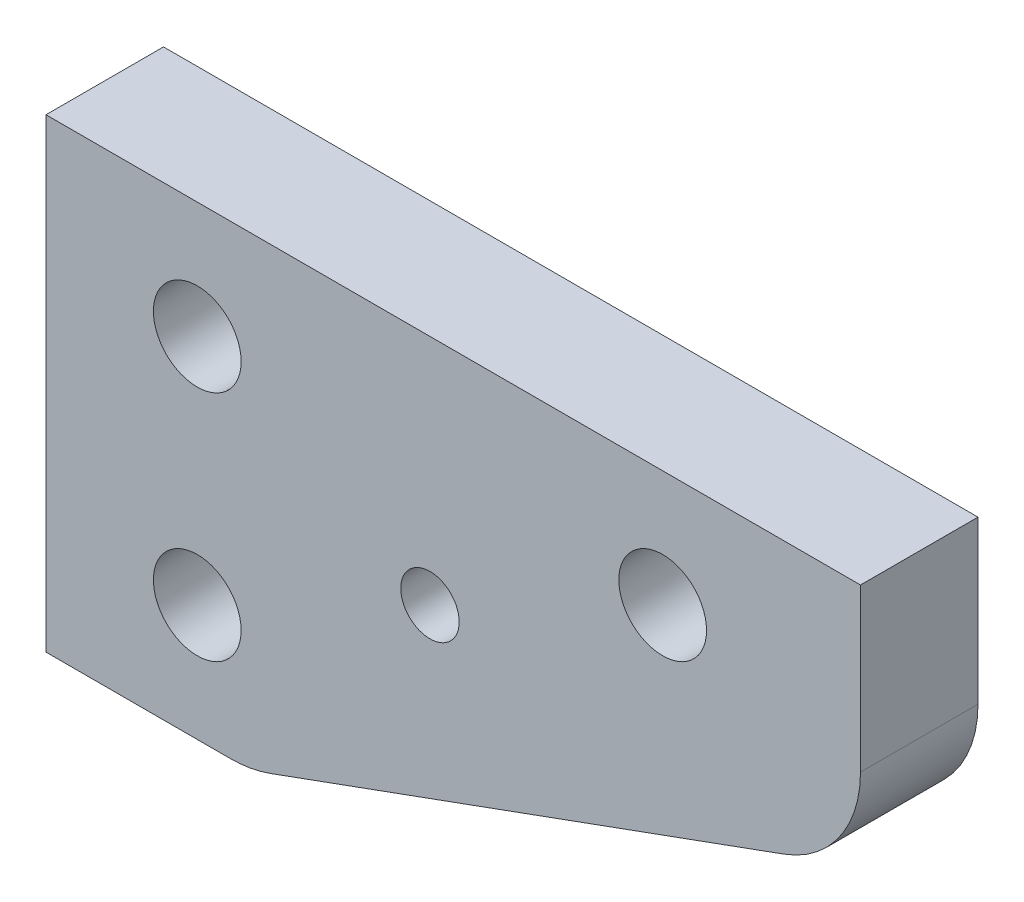
ISO-10303-21;
HEADER;
FILE_DESCRIPTION(('STEP AP214'),'2;1');
FILE_NAME('part.step','',(''),(''),'','','');
FILE_SCHEMA(('AUTOMOTIVE_DESIGN { 1 0 10303 214 1 1 1 1 }'));
ENDSEC;
DATA;
#1=APPLICATION_CONTEXT('core data for automotive mechanical design processes');
#2=APPLICATION_PROTOCOL_DEFINITION('international standard','automotive_design',2000,#1);
#3=PRODUCT_CONTEXT('',#1,'mechanical');
#4=PRODUCT('Part','Part','',(#3));
#5=PRODUCT_RELATED_PRODUCT_CATEGORY('part','',(#4));
#6=PRODUCT_DEFINITION_FORMATION('','',#4);
#7=PRODUCT_DEFINITION_CONTEXT('part definition',#1,'design');
#8=PRODUCT_DEFINITION('design','',#6,#7);
#9=PRODUCT_DEFINITION_SHAPE('','',#8);
#10=(LENGTH_UNIT() NAMED_UNIT(*) SI_UNIT(.MILLI.,.METRE.));
#11=(NAMED_UNIT(*) PLANE_ANGLE_UNIT() SI_UNIT($,.RADIAN.));
#12=(NAMED_UNIT(*) SI_UNIT($,.STERADIAN.) SOLID_ANGLE_UNIT());
#13=UNCERTAINTY_MEASURE_WITH_UNIT(LENGTH_MEASURE(1.E-05),#10,'distance_accuracy_value','');
#14=(GEOMETRIC_REPRESENTATION_CONTEXT(3) GLOBAL_UNCERTAINTY_ASSIGNED_CONTEXT((#13)) GLOBAL_UNIT_ASSIGNED_CONTEXT((#10,
#11,#12)) REPRESENTATION_CONTEXT('',''));
#15=CARTESIAN_POINT('',(0.,0.,0.));
#16=DIRECTION('',(0.,0.,1.));
#17=DIRECTION('',(1.,0.,0.));
#18=AXIS2_PLACEMENT_3D('',#15,#16,#17);
#19=CARTESIAN_POINT('',(0.,0.,6.4135));
#20=DIRECTION('',(0.,0.,1.));
#21=DIRECTION('',(1.,0.,0.));
#22=AXIS2_PLACEMENT_3D('',#19,#20,#21);
#23=PLANE('',#22);
#24=CARTESIAN_POINT('',(67.31,38.1,6.4135));
#25=DIRECTION('',(0.,0.,1.));
#26=DIRECTION('',(1.,0.,0.));
#27=AXIS2_PLACEMENT_3D('',#24,#25,#26);
#28=CIRCLE('',#27,4.7879);
#29=CARTESIAN_POINT('',(72.0979,38.1,6.4135));
#30=VERTEX_POINT('',#29);
#31=EDGE_CURVE('E210',#30,#30,#28,.T.);
#32=ORIENTED_EDGE('',*,*,#31,.F.);
#33=EDGE_LOOP('',(#32));
#34=FACE_BOUND('',#33,.T.);
#35=CARTESIAN_POINT('',(16.51,12.7,6.4135));
#36=DIRECTION('',(0.,0.,1.));
#37=DIRECTION('',(1.,0.,0.));
#38=AXIS2_PLACEMENT_3D('',#35,#36,#37);
#39=CIRCLE('',#38,4.7879);
#40=CARTESIAN_POINT('',(21.2979,12.7,6.4135));
#41=VERTEX_POINT('',#40);
#42=EDGE_CURVE('E193',#41,#41,#39,.T.);
#43=ORIENTED_EDGE('',*,*,#42,.F.);
#44=EDGE_LOOP('',(#43));
#45=FACE_BOUND('',#44,.T.);
#46=DIRECTION('',(0.939692620785908,0.342020143325669,0.));
#47=VECTOR('',#46,1.);
#48=CARTESIAN_POINT('',(22.352,0.,6.4135));
#49=LINE('',#48,#47);
#50=CARTESIAN_POINT('',(24.4563031652385,0.765903716018965,6.4135));
#51=VERTEX_POINT('',#50);
#52=CARTESIAN_POINT('',(80.543655820236,21.1800306012296,6.4135));
#53=VERTEX_POINT('',#52);
#54=EDGE_CURVE('E113',#51,#53,#49,.T.);
#55=ORIENTED_EDGE('',*,*,#54,.T.);
#56=CARTESIAN_POINT('',(76.2,33.1141268852106,6.4135));
#57=DIRECTION('',(0.,0.,1.));
#58=DIRECTION('',(1.,0.,0.));
#59=AXIS2_PLACEMENT_3D('',#56,#57,#58);
#60=CIRCLE('',#59,12.7);
#61=CARTESIAN_POINT('',(88.9,33.1141268852106,6.4135));
#62=VERTEX_POINT('',#61);
#63=EDGE_CURVE('E54',#53,#62,#60,.T.);
#64=ORIENTED_EDGE('',*,*,#63,.T.);
#65=DIRECTION('',(0.,1.,0.));
#66=VECTOR('',#65,1.);
#67=CARTESIAN_POINT('',(88.9,24.2214911499473,6.4135));
#68=LINE('',#67,#66);
#69=CARTESIAN_POINT('',(88.9,50.8,6.4135));
#70=VERTEX_POINT('',#69);
#71=EDGE_CURVE('E159',#62,#70,#68,.T.);
#72=ORIENTED_EDGE('',*,*,#71,.T.);
#73=DIRECTION('',(-1.,0.,0.));
#74=VECTOR('',#73,1.);
#75=CARTESIAN_POINT('',(88.9,50.8,6.4135));
#76=LINE('',#75,#74);
#77=CARTESIAN_POINT('',(0.,50.8,6.4135));
#78=VERTEX_POINT('',#77);
#79=EDGE_CURVE('E119',#70,#78,#76,.T.);
#80=ORIENTED_EDGE('',*,*,#79,.T.);
#81=DIRECTION('',(0.,-1.,0.));
#82=VECTOR('',#81,1.);
#83=CARTESIAN_POINT('',(0.,50.8,6.4135));
#84=LINE('',#83,#82);
#85=CARTESIAN_POINT('',(0.,0.,6.4135));
#86=VERTEX_POINT('',#85);
#87=EDGE_CURVE('E114',#78,#86,#84,.T.);
#88=ORIENTED_EDGE('',*,*,#87,.T.);
#89=DIRECTION('',(1.,0.,0.));
#90=VECTOR('',#89,1.);
#91=CARTESIAN_POINT('',(0.,0.,6.4135));
#92=LINE('',#91,#90);
#93=CARTESIAN_POINT('',(20.1126473450025,0.,6.4135));
#94=VERTEX_POINT('',#93);
#95=EDGE_CURVE('E104',#86,#94,#92,.T.);
#96=ORIENTED_EDGE('',*,*,#95,.T.);
#97=CARTESIAN_POINT('',(20.1126473450025,12.7,6.4135));
#98=DIRECTION('',(0.,0.,1.));
#99=DIRECTION('',(1.,0.,0.));
#100=AXIS2_PLACEMENT_3D('',#97,#98,#99);
#101=CIRCLE('',#100,12.7);
#102=EDGE_CURVE('E154',#94,#51,#101,.T.);
#103=ORIENTED_EDGE('',*,*,#102,.T.);
#104=EDGE_LOOP('',(#55,#64,#72,#80,#88,#96,#103));
#105=FACE_BOUND('',#104,.T.);
#106=CARTESIAN_POINT('',(16.51,38.1,6.4135));
#107=DIRECTION('',(0.,0.,1.));
#108=DIRECTION('',(1.,0.,0.));
#109=AXIS2_PLACEMENT_3D('',#106,#107,#108);
#110=CIRCLE('',#109,4.7879);
#111=CARTESIAN_POINT('',(21.2979,38.1,6.4135));
#112=VERTEX_POINT('',#111);
#113=EDGE_CURVE('E202',#112,#112,#110,.T.);
#114=ORIENTED_EDGE('',*,*,#113,.F.);
#115=EDGE_LOOP('',(#114));
#116=FACE_BOUND('',#115,.T.);
#117=CARTESIAN_POINT('',(41.91,25.4,6.4135));
#118=DIRECTION('',(0.,0.,1.));
#119=DIRECTION('',(1.,0.,0.));
#120=AXIS2_PLACEMENT_3D('',#117,#118,#119);
#121=CIRCLE('',#120,3.1877);
#122=CARTESIAN_POINT('',(45.0977,25.4,6.4135));
#123=VERTEX_POINT('',#122);
#124=EDGE_CURVE('E218',#123,#123,#121,.T.);
#125=ORIENTED_EDGE('',*,*,#124,.F.);
#126=EDGE_LOOP('',(#125));
#127=FACE_BOUND('',#126,.T.);
#128=ADVANCED_FACE('F45',(#34,#45,#105,#116,#127),#23,.T.);
#129=CARTESIAN_POINT('',(0.,0.,-6.4135));
#130=DIRECTION('',(0.,0.,1.));
#131=DIRECTION('',(1.,0.,0.));
#132=AXIS2_PLACEMENT_3D('',#129,#130,#131);
#133=PLANE('',#132);
#134=DIRECTION('',(0.,1.,0.));
#135=VECTOR('',#134,1.);
#136=CARTESIAN_POINT('',(88.9,24.2214911499473,-6.4135));
#137=LINE('',#136,#135);
#138=CARTESIAN_POINT('',(88.9,33.1141268852106,-6.4135));
#139=VERTEX_POINT('',#138);
#140=CARTESIAN_POINT('',(88.9,50.8,-6.4135));
#141=VERTEX_POINT('',#140);
#142=EDGE_CURVE('E175',#139,#141,#137,.T.);
#143=ORIENTED_EDGE('',*,*,#142,.F.);
#144=CARTESIAN_POINT('',(76.2,33.1141268852106,-6.4135));
#145=DIRECTION('',(0.,0.,1.));
#146=DIRECTION('',(1.,0.,0.));
#147=AXIS2_PLACEMENT_3D('',#144,#145,#146);
#148=CIRCLE('',#147,12.7);
#149=CARTESIAN_POINT('',(80.543655820236,21.1800306012296,-6.4135));
#150=VERTEX_POINT('',#149);
#151=EDGE_CURVE('E145',#139,#150,#148,.F.);
#152=ORIENTED_EDGE('',*,*,#151,.T.);
#153=DIRECTION('',(0.939692620785908,0.342020143325669,0.));
#154=VECTOR('',#153,1.);
#155=CARTESIAN_POINT('',(22.352,0.,-6.4135));
#156=LINE('',#155,#154);
#157=CARTESIAN_POINT('',(24.4563031652385,0.765903716018965,-6.4135));
#158=VERTEX_POINT('',#157);
#159=EDGE_CURVE('E173',#158,#150,#156,.T.);
#160=ORIENTED_EDGE('',*,*,#159,.F.);
#161=CARTESIAN_POINT('',(20.1126473450025,12.7,-6.4135));
#162=DIRECTION('',(0.,0.,1.));
#163=DIRECTION('',(1.,0.,0.));
#164=AXIS2_PLACEMENT_3D('',#161,#162,#163);
#165=CIRCLE('',#164,12.7);
#166=CARTESIAN_POINT('',(20.1126473450025,0.,-6.4135));
#167=VERTEX_POINT('',#166);
#168=EDGE_CURVE('E136',#158,#167,#165,.F.);
#169=ORIENTED_EDGE('',*,*,#168,.T.);
#170=DIRECTION('',(1.,0.,0.));
#171=VECTOR('',#170,1.);
#172=CARTESIAN_POINT('',(0.,0.,-6.4135));
#173=LINE('',#172,#171);
#174=CARTESIAN_POINT('',(0.,0.,-6.4135));
#175=VERTEX_POINT('',#174);
#176=EDGE_CURVE('E179',#175,#167,#173,.T.);
#177=ORIENTED_EDGE('',*,*,#176,.F.);
#178=DIRECTION('',(0.,-1.,0.));
#179=VECTOR('',#178,1.);
#180=CARTESIAN_POINT('',(0.,50.8,-6.4135));
#181=LINE('',#180,#179);
#182=CARTESIAN_POINT('',(0.,50.8,-6.4135));
#183=VERTEX_POINT('',#182);
#184=EDGE_CURVE('E128',#183,#175,#181,.T.);
#185=ORIENTED_EDGE('',*,*,#184,.F.);
#186=DIRECTION('',(-1.,0.,0.));
#187=VECTOR('',#186,1.);
#188=CARTESIAN_POINT('',(88.9,50.8,-6.4135));
#189=LINE('',#188,#187);
#190=EDGE_CURVE('E124',#141,#183,#189,.T.);
#191=ORIENTED_EDGE('',*,*,#190,.F.);
#192=EDGE_LOOP('',(#143,#152,#160,#169,#177,#185,#191));
#193=FACE_BOUND('',#192,.T.);
#194=CARTESIAN_POINT('',(16.51,12.7,-6.4135));
#195=DIRECTION('',(0.,0.,1.));
#196=DIRECTION('',(1.,0.,0.));
#197=AXIS2_PLACEMENT_3D('',#194,#195,#196);
#198=CIRCLE('',#197,4.7879);
#199=CARTESIAN_POINT('',(21.2979,12.7,-6.4135));
#200=VERTEX_POINT('',#199);
#201=EDGE_CURVE('E196',#200,#200,#198,.T.);
#202=ORIENTED_EDGE('',*,*,#201,.T.);
#203=EDGE_LOOP('',(#202));
#204=FACE_BOUND('',#203,.T.);
#205=CARTESIAN_POINT('',(16.51,38.1,-6.4135));
#206=DIRECTION('',(0.,0.,1.));
#207=DIRECTION('',(1.,0.,0.));
#208=AXIS2_PLACEMENT_3D('',#205,#206,#207);
#209=CIRCLE('',#208,4.7879);
#210=CARTESIAN_POINT('',(21.2979,38.1,-6.4135));
#211=VERTEX_POINT('',#210);
#212=EDGE_CURVE('E205',#211,#211,#209,.T.);
#213=ORIENTED_EDGE('',*,*,#212,.T.);
#214=EDGE_LOOP('',(#213));
#215=FACE_BOUND('',#214,.T.);
#216=CARTESIAN_POINT('',(67.31,38.1,-6.4135));
#217=DIRECTION('',(0.,0.,1.));
#218=DIRECTION('',(1.,0.,0.));
#219=AXIS2_PLACEMENT_3D('',#216,#217,#218);
#220=CIRCLE('',#219,4.7879);
#221=CARTESIAN_POINT('',(72.0979,38.1,-6.4135));
#222=VERTEX_POINT('',#221);
#223=EDGE_CURVE('E214',#222,#222,#220,.T.);
#224=ORIENTED_EDGE('',*,*,#223,.T.);
#225=EDGE_LOOP('',(#224));
#226=FACE_BOUND('',#225,.T.);
#227=CARTESIAN_POINT('',(41.91,25.4,-6.4135));
#228=DIRECTION('',(0.,0.,1.));
#229=DIRECTION('',(1.,0.,0.));
#230=AXIS2_PLACEMENT_3D('',#227,#228,#229);
#231=CIRCLE('',#230,3.1877);
#232=CARTESIAN_POINT('',(45.0977,25.4,-6.4135));
#233=VERTEX_POINT('',#232);
#234=EDGE_CURVE('E222',#233,#233,#231,.T.);
#235=ORIENTED_EDGE('',*,*,#234,.T.);
#236=EDGE_LOOP('',(#235));
#237=FACE_BOUND('',#236,.T.);
#238=ADVANCED_FACE('F171',(#193,#204,#215,#226,#237),#133,.F.);
#239=CARTESIAN_POINT('',(0.,50.8,6.4135));
#240=DIRECTION('',(1.,0.,0.));
#241=DIRECTION('',(0.,1.,0.));
#242=AXIS2_PLACEMENT_3D('',#239,#240,#241);
#243=PLANE('',#242);
#244=ORIENTED_EDGE('',*,*,#184,.T.);
#245=DIRECTION('',(0.,0.,-1.));
#246=VECTOR('',#245,1.);
#247=CARTESIAN_POINT('',(0.,0.,6.4135));
#248=LINE('',#247,#246);
#249=EDGE_CURVE('E108',#86,#175,#248,.T.);
#250=ORIENTED_EDGE('',*,*,#249,.F.);
#251=ORIENTED_EDGE('',*,*,#87,.F.);
#252=DIRECTION('',(0.,0.,-1.));
#253=VECTOR('',#252,1.);
#254=CARTESIAN_POINT('',(0.,50.8,6.4135));
#255=LINE('',#254,#253);
#256=EDGE_CURVE('E139',#78,#183,#255,.T.);
#257=ORIENTED_EDGE('',*,*,#256,.T.);
#258=EDGE_LOOP('',(#244,#250,#251,#257));
#259=FACE_BOUND('',#258,.T.);
#260=ADVANCED_FACE('F126',(#259),#243,.F.);
#261=CARTESIAN_POINT('',(0.,0.,6.4135));
#262=DIRECTION('',(0.,1.,0.));
#263=DIRECTION('',(0.,0.,1.));
#264=AXIS2_PLACEMENT_3D('',#261,#262,#263);
#265=PLANE('',#264);
#266=ORIENTED_EDGE('',*,*,#176,.T.);
#267=DIRECTION('',(0.,0.,-1.));
#268=VECTOR('',#267,1.);
#269=CARTESIAN_POINT('',(20.1126473450025,0.,6.4135));
#270=LINE('',#269,#268);
#271=EDGE_CURVE('E11',#167,#94,#270,.F.);
#272=ORIENTED_EDGE('',*,*,#271,.T.);
#273=ORIENTED_EDGE('',*,*,#95,.F.);
#274=ORIENTED_EDGE('',*,*,#249,.T.);
#275=EDGE_LOOP('',(#266,#272,#273,#274));
#276=FACE_BOUND('',#275,.T.);
#277=ADVANCED_FACE('F106',(#276),#265,.F.);
#278=CARTESIAN_POINT('',(22.352,0.,6.4135));
#279=DIRECTION('',(-0.342020143325669,0.939692620785908,0.));
#280=DIRECTION('',(-0.939692620785908,-0.342020143325669,0.));
#281=AXIS2_PLACEMENT_3D('',#278,#279,#280);
#282=PLANE('',#281);
#283=ORIENTED_EDGE('',*,*,#159,.T.);
#284=DIRECTION('',(0.,0.,-1.));
#285=VECTOR('',#284,1.);
#286=CARTESIAN_POINT('',(80.543655820236,21.1800306012296,6.4135));
#287=LINE('',#286,#285);
#288=EDGE_CURVE('E67',#150,#53,#287,.F.);
#289=ORIENTED_EDGE('',*,*,#288,.T.);
#290=ORIENTED_EDGE('',*,*,#54,.F.);
#291=DIRECTION('',(0.,0.,-1.));
#292=VECTOR('',#291,1.);
#293=CARTESIAN_POINT('',(24.4563031652385,0.765903716018965,6.4135));
#294=LINE('',#293,#292);
#295=EDGE_CURVE('E148',#51,#158,#294,.T.);
#296=ORIENTED_EDGE('',*,*,#295,.T.);
#297=EDGE_LOOP('',(#283,#289,#290,#296));
#298=FACE_BOUND('',#297,.T.);
#299=ADVANCED_FACE('F176',(#298),#282,.F.);
#300=CARTESIAN_POINT('',(88.9,24.2214911499473,6.4135));
#301=DIRECTION('',(-1.,0.,0.));
#302=DIRECTION('',(0.,0.,1.));
#303=AXIS2_PLACEMENT_3D('',#300,#301,#302);
#304=PLANE('',#303);
#305=ORIENTED_EDGE('',*,*,#71,.F.);
#306=DIRECTION('',(0.,0.,-1.));
#307=VECTOR('',#306,1.);
#308=CARTESIAN_POINT('',(88.9,33.1141268852106,6.4135));
#309=LINE('',#308,#307);
#310=EDGE_CURVE('E130',#62,#139,#309,.T.);
#311=ORIENTED_EDGE('',*,*,#310,.T.);
#312=ORIENTED_EDGE('',*,*,#142,.T.);
#313=DIRECTION('',(0.,0.,-1.));
#314=VECTOR('',#313,1.);
#315=CARTESIAN_POINT('',(88.9,50.8,6.4135));
#316=LINE('',#315,#314);
#317=EDGE_CURVE('E131',#70,#141,#316,.T.);
#318=ORIENTED_EDGE('',*,*,#317,.F.);
#319=EDGE_LOOP('',(#305,#311,#312,#318));
#320=FACE_BOUND('',#319,.T.);
#321=ADVANCED_FACE('F164',(#320),#304,.F.);
#322=CARTESIAN_POINT('',(88.9,50.8,6.4135));
#323=DIRECTION('',(0.,-1.,0.));
#324=DIRECTION('',(1.,0.,0.));
#325=AXIS2_PLACEMENT_3D('',#322,#323,#324);
#326=PLANE('',#325);
#327=ORIENTED_EDGE('',*,*,#190,.T.);
#328=ORIENTED_EDGE('',*,*,#256,.F.);
#329=ORIENTED_EDGE('',*,*,#79,.F.);
#330=ORIENTED_EDGE('',*,*,#317,.T.);
#331=EDGE_LOOP('',(#327,#328,#329,#330));
#332=FACE_BOUND('',#331,.T.);
#333=ADVANCED_FACE('F247',(#332),#326,.F.);
#334=CARTESIAN_POINT('',(16.51,12.7,6.4135));
#335=DIRECTION('',(0.,0.,-1.));
#336=DIRECTION('',(-1.,0.,0.));
#337=AXIS2_PLACEMENT_3D('',#334,#335,#336);
#338=CYLINDRICAL_SURFACE('',#337,4.7879);
#339=ORIENTED_EDGE('',*,*,#42,.T.);
#340=EDGE_LOOP('',(#339));
#341=FACE_BOUND('',#340,.T.);
#342=ORIENTED_EDGE('',*,*,#201,.F.);
#343=EDGE_LOOP('',(#342));
#344=FACE_BOUND('',#343,.T.);
#345=ADVANCED_FACE('F244',(#341,#344),#338,.F.);
#346=CARTESIAN_POINT('',(16.51,38.1,6.4135));
#347=DIRECTION('',(0.,0.,-1.));
#348=DIRECTION('',(-1.,0.,0.));
#349=AXIS2_PLACEMENT_3D('',#346,#347,#348);
#350=CYLINDRICAL_SURFACE('',#349,4.7879);
#351=ORIENTED_EDGE('',*,*,#113,.T.);
#352=EDGE_LOOP('',(#351));
#353=FACE_BOUND('',#352,.T.);
#354=ORIENTED_EDGE('',*,*,#212,.F.);
#355=EDGE_LOOP('',(#354));
#356=FACE_BOUND('',#355,.T.);
#357=ADVANCED_FACE('F268',(#353,#356),#350,.F.);
#358=CARTESIAN_POINT('',(67.31,38.1,6.4135));
#359=DIRECTION('',(0.,0.,-1.));
#360=DIRECTION('',(-1.,0.,0.));
#361=AXIS2_PLACEMENT_3D('',#358,#359,#360);
#362=CYLINDRICAL_SURFACE('',#361,4.7879);
#363=ORIENTED_EDGE('',*,*,#31,.T.);
#364=EDGE_LOOP('',(#363));
#365=FACE_BOUND('',#364,.T.);
#366=ORIENTED_EDGE('',*,*,#223,.F.);
#367=EDGE_LOOP('',(#366));
#368=FACE_BOUND('',#367,.T.);
#369=ADVANCED_FACE('F263',(#365,#368),#362,.F.);
#370=CARTESIAN_POINT('',(41.91,25.4,6.4135));
#371=DIRECTION('',(0.,0.,-1.));
#372=DIRECTION('',(-1.,0.,0.));
#373=AXIS2_PLACEMENT_3D('',#370,#371,#372);
#374=CYLINDRICAL_SURFACE('',#373,3.1877);
#375=ORIENTED_EDGE('',*,*,#124,.T.);
#376=EDGE_LOOP('',(#375));
#377=FACE_BOUND('',#376,.T.);
#378=ORIENTED_EDGE('',*,*,#234,.F.);
#379=EDGE_LOOP('',(#378));
#380=FACE_BOUND('',#379,.T.);
#381=ADVANCED_FACE('F230',(#377,#380),#374,.F.);
#382=CARTESIAN_POINT('',(76.2,33.1141268852106,6.4135));
#383=DIRECTION('',(0.,0.,-1.));
#384=DIRECTION('',(-1.,0.,0.));
#385=AXIS2_PLACEMENT_3D('',#382,#383,#384);
#386=CYLINDRICAL_SURFACE('',#385,12.7);
#387=ORIENTED_EDGE('',*,*,#63,.F.);
#388=ORIENTED_EDGE('',*,*,#288,.F.);
#389=ORIENTED_EDGE('',*,*,#151,.F.);
#390=ORIENTED_EDGE('',*,*,#310,.F.);
#391=EDGE_LOOP('',(#387,#388,#389,#390));
#392=FACE_BOUND('',#391,.T.);
#393=ADVANCED_FACE('F168',(#392),#386,.T.);
#394=CARTESIAN_POINT('',(20.1126473450025,12.7,6.4135));
#395=DIRECTION('',(0.,0.,-1.));
#396=DIRECTION('',(-1.,0.,0.));
#397=AXIS2_PLACEMENT_3D('',#394,#395,#396);
#398=CYLINDRICAL_SURFACE('',#397,12.7);
#399=ORIENTED_EDGE('',*,*,#102,.F.);
#400=ORIENTED_EDGE('',*,*,#271,.F.);
#401=ORIENTED_EDGE('',*,*,#168,.F.);
#402=ORIENTED_EDGE('',*,*,#295,.F.);
#403=EDGE_LOOP('',(#399,#400,#401,#402));
#404=FACE_BOUND('',#403,.T.);
#405=ADVANCED_FACE('F47',(#404),#398,.T.);
#406=CLOSED_SHELL('',(#128,#238,#260,#277,#299,#321,#333,#345,#357,#369,#381,#393,#405));
#407=MANIFOLD_SOLID_BREP('B2',#406);
#408=ADVANCED_BREP_SHAPE_REPRESENTATION('',(#18,#407),#14);
#409=SHAPE_DEFINITION_REPRESENTATION(#9,#408);
ENDSEC;
END-ISO-10303-21;
